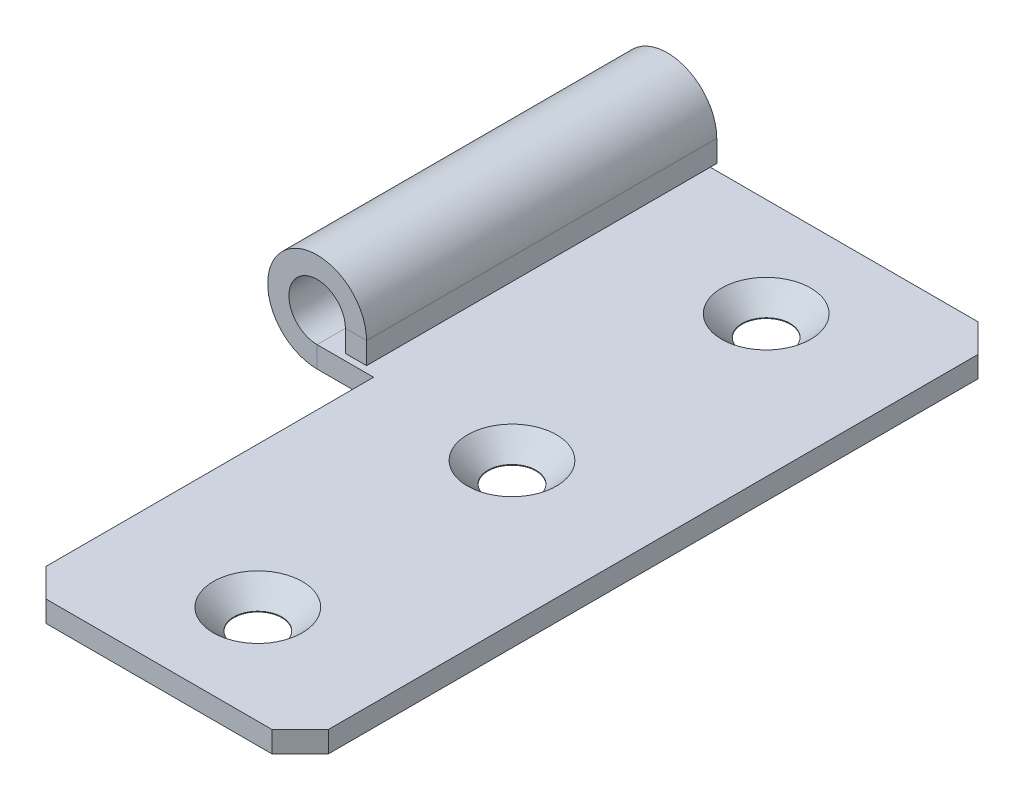
ISO-10303-21;
HEADER;
FILE_DESCRIPTION(('STEP AP214'),'2;1');
FILE_NAME('part.step','',(''),(''),'','','');
FILE_SCHEMA(('AUTOMOTIVE_DESIGN { 1 0 10303 214 1 1 1 1 }'));
ENDSEC;
DATA;
#1=APPLICATION_CONTEXT('core data for automotive mechanical design processes');
#2=APPLICATION_PROTOCOL_DEFINITION('international standard','automotive_design',2000,#1);
#3=PRODUCT_CONTEXT('',#1,'mechanical');
#4=PRODUCT('Part','Part','',(#3));
#5=PRODUCT_RELATED_PRODUCT_CATEGORY('part','',(#4));
#6=PRODUCT_DEFINITION_FORMATION('','',#4);
#7=PRODUCT_DEFINITION_CONTEXT('part definition',#1,'design');
#8=PRODUCT_DEFINITION('design','',#6,#7);
#9=PRODUCT_DEFINITION_SHAPE('','',#8);
#10=(LENGTH_UNIT() NAMED_UNIT(*) SI_UNIT(.MILLI.,.METRE.));
#11=(NAMED_UNIT(*) PLANE_ANGLE_UNIT() SI_UNIT($,.RADIAN.));
#12=(NAMED_UNIT(*) SI_UNIT($,.STERADIAN.) SOLID_ANGLE_UNIT());
#13=UNCERTAINTY_MEASURE_WITH_UNIT(LENGTH_MEASURE(1.E-05),#10,'distance_accuracy_value','');
#14=(GEOMETRIC_REPRESENTATION_CONTEXT(3) GLOBAL_UNCERTAINTY_ASSIGNED_CONTEXT((#13)) GLOBAL_UNIT_ASSIGNED_CONTEXT((#10,
#11,#12)) REPRESENTATION_CONTEXT('',''));
#15=CARTESIAN_POINT('',(0.,0.,0.));
#16=DIRECTION('',(0.,0.,1.));
#17=DIRECTION('',(1.,0.,0.));
#18=AXIS2_PLACEMENT_3D('',#15,#16,#17);
#19=CARTESIAN_POINT('',(-10.4999999999997,28.9590696960579,0.));
#20=DIRECTION('',(-1.,0.,0.));
#21=DIRECTION('',(0.,0.,1.));
#22=AXIS2_PLACEMENT_3D('',#19,#20,#21);
#23=PLANE('',#22);
#24=DIRECTION('',(0.,-1.,0.));
#25=VECTOR('',#24,1.);
#26=CARTESIAN_POINT('',(-10.5,0.459069696057891,-50.));
#27=LINE('',#26,#25);
#28=CARTESIAN_POINT('',(-10.5,1.99999999999997,-50.));
#29=VERTEX_POINT('',#28);
#30=CARTESIAN_POINT('',(-10.5,0.459069696057891,-50.));
#31=VERTEX_POINT('',#30);
#32=EDGE_CURVE('E46',#29,#31,#27,.T.);
#33=ORIENTED_EDGE('',*,*,#32,.F.);
#34=DIRECTION('',(0.,0.,1.));
#35=VECTOR('',#34,1.);
#36=CARTESIAN_POINT('',(-10.5,1.99999999999996,0.));
#37=LINE('',#36,#35);
#38=CARTESIAN_POINT('',(-10.5,1.99999999999996,-25.2));
#39=VERTEX_POINT('',#38);
#40=EDGE_CURVE('E86',#29,#39,#37,.T.);
#41=ORIENTED_EDGE('',*,*,#40,.T.);
#42=DIRECTION('',(0.,1.,0.));
#43=VECTOR('',#42,1.);
#44=CARTESIAN_POINT('',(-10.4999999999998,18.9590696960579,-25.2));
#45=LINE('',#44,#43);
#46=CARTESIAN_POINT('',(-10.5,0.459069696057891,-25.2));
#47=VERTEX_POINT('',#46);
#48=EDGE_CURVE('E106',#47,#39,#45,.T.);
#49=ORIENTED_EDGE('',*,*,#48,.F.);
#50=DIRECTION('',(0.,0.,1.));
#51=VECTOR('',#50,1.);
#52=CARTESIAN_POINT('',(-10.5,0.459069696057891,-25.2));
#53=LINE('',#52,#51);
#54=EDGE_CURVE('E85',#31,#47,#53,.T.);
#55=ORIENTED_EDGE('',*,*,#54,.F.);
#56=EDGE_LOOP('',(#33,#41,#49,#55));
#57=FACE_BOUND('',#56,.T.);
#58=ADVANCED_FACE('F42',(#57),#23,.F.);
#59=CARTESIAN_POINT('',(-10.4999999999998,18.9590696960579,-25.2));
#60=DIRECTION('',(0.,0.,1.));
#61=DIRECTION('',(0.,1.,0.));
#62=AXIS2_PLACEMENT_3D('',#59,#60,#61);
#63=PLANE('',#62);
#64=DIRECTION('',(1.,0.,0.));
#65=VECTOR('',#64,1.);
#66=CARTESIAN_POINT('',(-10.5,1.99999999999996,-25.2));
#67=LINE('',#66,#65);
#68=CARTESIAN_POINT('',(-12.,1.99999999999998,-25.2));
#69=VERTEX_POINT('',#68);
#70=EDGE_CURVE('E12',#69,#39,#67,.T.);
#71=ORIENTED_EDGE('',*,*,#70,.F.);
#72=DIRECTION('',(0.,1.,0.));
#73=VECTOR('',#72,1.);
#74=CARTESIAN_POINT('',(-11.9999999999998,18.9590696960579,-25.2));
#75=LINE('',#74,#73);
#76=CARTESIAN_POINT('',(-12.,0.459069696057909,-25.2));
#77=VERTEX_POINT('',#76);
#78=EDGE_CURVE('E91',#77,#69,#75,.T.);
#79=ORIENTED_EDGE('',*,*,#78,.F.);
#80=DIRECTION('',(-1.,0.,0.));
#81=VECTOR('',#80,1.);
#82=CARTESIAN_POINT('',(-10.5,0.459069696057891,-25.2));
#83=LINE('',#82,#81);
#84=EDGE_CURVE('E67',#47,#77,#83,.T.);
#85=ORIENTED_EDGE('',*,*,#84,.F.);
#86=ORIENTED_EDGE('',*,*,#48,.T.);
#87=EDGE_LOOP('',(#71,#79,#85,#86));
#88=FACE_BOUND('',#87,.T.);
#89=ADVANCED_FACE('F44',(#88),#63,.T.);
#90=CARTESIAN_POINT('',(-10.5,0.459069696057891,-25.2));
#91=DIRECTION('',(0.,-1.,0.));
#92=DIRECTION('',(0.,0.,1.));
#93=AXIS2_PLACEMENT_3D('',#90,#91,#92);
#94=PLANE('',#93);
#95=DIRECTION('',(0.,0.,1.));
#96=VECTOR('',#95,1.);
#97=CARTESIAN_POINT('',(-12.,0.459069696057909,-25.2));
#98=LINE('',#97,#96);
#99=CARTESIAN_POINT('',(-12.,0.459069696057909,-50.));
#100=VERTEX_POINT('',#99);
#101=EDGE_CURVE('E83',#100,#77,#98,.T.);
#102=ORIENTED_EDGE('',*,*,#101,.F.);
#103=DIRECTION('',(-1.,0.,0.));
#104=VECTOR('',#103,1.);
#105=CARTESIAN_POINT('',(-10.5,0.459069696057891,-50.));
#106=LINE('',#105,#104);
#107=EDGE_CURVE('E87',#31,#100,#106,.T.);
#108=ORIENTED_EDGE('',*,*,#107,.F.);
#109=ORIENTED_EDGE('',*,*,#54,.T.);
#110=ORIENTED_EDGE('',*,*,#84,.T.);
#111=EDGE_LOOP('',(#102,#108,#109,#110));
#112=FACE_BOUND('',#111,.T.);
#113=ADVANCED_FACE('F80',(#112),#94,.T.);
#114=CARTESIAN_POINT('',(-10.5,0.459069696057891,-50.));
#115=DIRECTION('',(0.,0.,-1.));
#116=DIRECTION('',(0.,-1.,0.));
#117=AXIS2_PLACEMENT_3D('',#114,#115,#116);
#118=PLANE('',#117);
#119=DIRECTION('',(-1.,0.,0.));
#120=VECTOR('',#119,1.);
#121=CARTESIAN_POINT('',(-10.5,1.99999999999996,-50.));
#122=LINE('',#121,#120);
#123=CARTESIAN_POINT('',(-12.,1.99999999999998,-50.));
#124=VERTEX_POINT('',#123);
#125=EDGE_CURVE('E109',#29,#124,#122,.T.);
#126=ORIENTED_EDGE('',*,*,#125,.F.);
#127=ORIENTED_EDGE('',*,*,#32,.T.);
#128=ORIENTED_EDGE('',*,*,#107,.T.);
#129=DIRECTION('',(0.,-1.,0.));
#130=VECTOR('',#129,1.);
#131=CARTESIAN_POINT('',(-12.,0.459069696057909,-50.));
#132=LINE('',#131,#130);
#133=EDGE_CURVE('E98',#124,#100,#132,.T.);
#134=ORIENTED_EDGE('',*,*,#133,.F.);
#135=EDGE_LOOP('',(#126,#127,#128,#134));
#136=FACE_BOUND('',#135,.T.);
#137=ADVANCED_FACE('F117',(#136),#118,.T.);
#138=CARTESIAN_POINT('',(-11.9999999999997,28.9590696960579,0.));
#139=DIRECTION('',(-1.,0.,0.));
#140=DIRECTION('',(0.,0.,1.));
#141=AXIS2_PLACEMENT_3D('',#138,#139,#140);
#142=PLANE('',#141);
#143=DIRECTION('',(0.,0.,1.));
#144=VECTOR('',#143,1.);
#145=CARTESIAN_POINT('',(-12.,1.99999999999998,0.));
#146=LINE('',#145,#144);
#147=EDGE_CURVE('E51',#124,#69,#146,.T.);
#148=ORIENTED_EDGE('',*,*,#147,.F.);
#149=ORIENTED_EDGE('',*,*,#133,.T.);
#150=ORIENTED_EDGE('',*,*,#101,.T.);
#151=ORIENTED_EDGE('',*,*,#78,.T.);
#152=EDGE_LOOP('',(#148,#149,#150,#151));
#153=FACE_BOUND('',#152,.T.);
#154=ADVANCED_FACE('F96',(#153),#142,.T.);
#155=CARTESIAN_POINT('',(0.,0.,-43.));
#156=DIRECTION('',(0.,1.,0.));
#157=DIRECTION('',(0.,0.,1.));
#158=AXIS2_PLACEMENT_3D('',#155,#156,#157);
#159=CONICAL_SURFACE('',#158,3.15,0.78539816339745);
#160=CARTESIAN_POINT('',(0.,-1.45,-43.));
#161=DIRECTION('',(0.,1.,0.));
#162=DIRECTION('',(0.,0.,1.));
#163=AXIS2_PLACEMENT_3D('',#160,#161,#162);
#164=CIRCLE('',#163,1.7);
#165=CARTESIAN_POINT('',(0.,-1.45,-41.3));
#166=VERTEX_POINT('',#165);
#167=EDGE_CURVE('E229',#166,#166,#164,.T.);
#168=ORIENTED_EDGE('',*,*,#167,.F.);
#169=EDGE_LOOP('',(#168));
#170=FACE_BOUND('',#169,.T.);
#171=CARTESIAN_POINT('',(0.,0.,-43.));
#172=DIRECTION('',(0.,1.,0.));
#173=DIRECTION('',(0.,0.,1.));
#174=AXIS2_PLACEMENT_3D('',#171,#172,#173);
#175=CIRCLE('',#174,3.15);
#176=CARTESIAN_POINT('',(0.,0.,-39.85));
#177=VERTEX_POINT('',#176);
#178=EDGE_CURVE('E244',#177,#177,#175,.T.);
#179=ORIENTED_EDGE('',*,*,#178,.T.);
#180=EDGE_LOOP('',(#179));
#181=FACE_BOUND('',#180,.T.);
#182=ADVANCED_FACE('F352',(#170,#181),#159,.F.);
#183=CARTESIAN_POINT('',(0.,0.,-25.));
#184=DIRECTION('',(0.,1.,0.));
#185=DIRECTION('',(0.,0.,1.));
#186=AXIS2_PLACEMENT_3D('',#183,#184,#185);
#187=CONICAL_SURFACE('',#186,3.15,0.78539816339745);
#188=CARTESIAN_POINT('',(0.,-1.45,-25.));
#189=DIRECTION('',(0.,1.,0.));
#190=DIRECTION('',(0.,0.,1.));
#191=AXIS2_PLACEMENT_3D('',#188,#189,#190);
#192=CIRCLE('',#191,1.7);
#193=CARTESIAN_POINT('',(0.,-1.45,-23.3));
#194=VERTEX_POINT('',#193);
#195=EDGE_CURVE('E232',#194,#194,#192,.T.);
#196=ORIENTED_EDGE('',*,*,#195,.F.);
#197=EDGE_LOOP('',(#196));
#198=FACE_BOUND('',#197,.T.);
#199=CARTESIAN_POINT('',(0.,0.,-25.));
#200=DIRECTION('',(0.,1.,0.));
#201=DIRECTION('',(0.,0.,1.));
#202=AXIS2_PLACEMENT_3D('',#199,#200,#201);
#203=CIRCLE('',#202,3.15);
#204=CARTESIAN_POINT('',(0.,0.,-21.85));
#205=VERTEX_POINT('',#204);
#206=EDGE_CURVE('E241',#205,#205,#203,.T.);
#207=ORIENTED_EDGE('',*,*,#206,.T.);
#208=EDGE_LOOP('',(#207));
#209=FACE_BOUND('',#208,.T.);
#210=ADVANCED_FACE('F356',(#198,#209),#187,.F.);
#211=CARTESIAN_POINT('',(0.,0.,-7.));
#212=DIRECTION('',(0.,1.,0.));
#213=DIRECTION('',(0.,0.,1.));
#214=AXIS2_PLACEMENT_3D('',#211,#212,#213);
#215=CONICAL_SURFACE('',#214,3.15,0.78539816339745);
#216=CARTESIAN_POINT('',(0.,-1.45,-7.));
#217=DIRECTION('',(0.,1.,0.));
#218=DIRECTION('',(0.,0.,1.));
#219=AXIS2_PLACEMENT_3D('',#216,#217,#218);
#220=CIRCLE('',#219,1.7);
#221=CARTESIAN_POINT('',(0.,-1.45,-5.3));
#222=VERTEX_POINT('',#221);
#223=EDGE_CURVE('E235',#222,#222,#220,.T.);
#224=ORIENTED_EDGE('',*,*,#223,.F.);
#225=EDGE_LOOP('',(#224));
#226=FACE_BOUND('',#225,.T.);
#227=CARTESIAN_POINT('',(0.,0.,-7.));
#228=DIRECTION('',(0.,1.,0.));
#229=DIRECTION('',(0.,0.,1.));
#230=AXIS2_PLACEMENT_3D('',#227,#228,#229);
#231=CIRCLE('',#230,3.15);
#232=CARTESIAN_POINT('',(0.,0.,-3.85));
#233=VERTEX_POINT('',#232);
#234=EDGE_CURVE('E238',#233,#233,#231,.T.);
#235=ORIENTED_EDGE('',*,*,#234,.T.);
#236=EDGE_LOOP('',(#235));
#237=FACE_BOUND('',#236,.T.);
#238=ADVANCED_FACE('F362',(#226,#237),#215,.F.);
#239=CARTESIAN_POINT('',(0.,0.,-7.));
#240=DIRECTION('',(0.,1.,0.));
#241=DIRECTION('',(0.,0.,1.));
#242=AXIS2_PLACEMENT_3D('',#239,#240,#241);
#243=CYLINDRICAL_SURFACE('',#242,1.7);
#244=CARTESIAN_POINT('',(0.,-1.5,-7.));
#245=DIRECTION('',(0.,1.,0.));
#246=DIRECTION('',(0.,0.,1.));
#247=AXIS2_PLACEMENT_3D('',#244,#245,#246);
#248=CIRCLE('',#247,1.7);
#249=CARTESIAN_POINT('',(0.,-1.5,-5.3));
#250=VERTEX_POINT('',#249);
#251=EDGE_CURVE('E187',#250,#250,#248,.T.);
#252=ORIENTED_EDGE('',*,*,#251,.F.);
#253=EDGE_LOOP('',(#252));
#254=FACE_BOUND('',#253,.T.);
#255=ORIENTED_EDGE('',*,*,#223,.T.);
#256=EDGE_LOOP('',(#255));
#257=FACE_BOUND('',#256,.T.);
#258=ADVANCED_FACE('F372',(#254,#257),#243,.F.);
#259=CARTESIAN_POINT('',(0.,0.,-25.));
#260=DIRECTION('',(0.,1.,0.));
#261=DIRECTION('',(0.,0.,1.));
#262=AXIS2_PLACEMENT_3D('',#259,#260,#261);
#263=CYLINDRICAL_SURFACE('',#262,1.7);
#264=CARTESIAN_POINT('',(0.,-1.5,-25.));
#265=DIRECTION('',(0.,1.,0.));
#266=DIRECTION('',(0.,0.,1.));
#267=AXIS2_PLACEMENT_3D('',#264,#265,#266);
#268=CIRCLE('',#267,1.7);
#269=CARTESIAN_POINT('',(0.,-1.5,-23.3));
#270=VERTEX_POINT('',#269);
#271=EDGE_CURVE('E190',#270,#270,#268,.T.);
#272=ORIENTED_EDGE('',*,*,#271,.F.);
#273=EDGE_LOOP('',(#272));
#274=FACE_BOUND('',#273,.T.);
#275=ORIENTED_EDGE('',*,*,#195,.T.);
#276=EDGE_LOOP('',(#275));
#277=FACE_BOUND('',#276,.T.);
#278=ADVANCED_FACE('F339',(#274,#277),#263,.F.);
#279=CARTESIAN_POINT('',(0.,0.,-43.));
#280=DIRECTION('',(0.,1.,0.));
#281=DIRECTION('',(0.,0.,1.));
#282=AXIS2_PLACEMENT_3D('',#279,#280,#281);
#283=CYLINDRICAL_SURFACE('',#282,1.7);
#284=CARTESIAN_POINT('',(0.,-1.5,-43.));
#285=DIRECTION('',(0.,1.,0.));
#286=DIRECTION('',(0.,0.,1.));
#287=AXIS2_PLACEMENT_3D('',#284,#285,#286);
#288=CIRCLE('',#287,1.7);
#289=CARTESIAN_POINT('',(0.,-1.5,-41.3));
#290=VERTEX_POINT('',#289);
#291=EDGE_CURVE('E193',#290,#290,#288,.T.);
#292=ORIENTED_EDGE('',*,*,#291,.F.);
#293=EDGE_LOOP('',(#292));
#294=FACE_BOUND('',#293,.T.);
#295=ORIENTED_EDGE('',*,*,#167,.T.);
#296=EDGE_LOOP('',(#295));
#297=FACE_BOUND('',#296,.T.);
#298=ADVANCED_FACE('F332',(#294,#297),#283,.F.);
#299=CARTESIAN_POINT('',(-10.,-1.5,-25.2));
#300=DIRECTION('',(-1.,0.,0.));
#301=DIRECTION('',(0.,0.,1.));
#302=AXIS2_PLACEMENT_3D('',#299,#300,#301);
#303=PLANE('',#302);
#304=DIRECTION('',(0.,0.,1.));
#305=VECTOR('',#304,1.);
#306=CARTESIAN_POINT('',(-10.,-1.5,-25.2));
#307=LINE('',#306,#305);
#308=CARTESIAN_POINT('',(-10.,-1.5,-25.2));
#309=VERTEX_POINT('',#308);
#310=CARTESIAN_POINT('',(-10.,-1.5,-2.00000000000001));
#311=VERTEX_POINT('',#310);
#312=EDGE_CURVE('E226',#309,#311,#307,.T.);
#313=ORIENTED_EDGE('',*,*,#312,.T.);
#314=DIRECTION('',(0.,1.,0.));
#315=VECTOR('',#314,1.);
#316=CARTESIAN_POINT('',(-10.,-1.5,-2.00000000000001));
#317=LINE('',#316,#315);
#318=CARTESIAN_POINT('',(-10.,0.,-2.00000000000001));
#319=VERTEX_POINT('',#318);
#320=EDGE_CURVE('E223',#311,#319,#317,.T.);
#321=ORIENTED_EDGE('',*,*,#320,.T.);
#322=DIRECTION('',(0.,0.,1.));
#323=VECTOR('',#322,1.);
#324=CARTESIAN_POINT('',(-10.,0.,-25.2));
#325=LINE('',#324,#323);
#326=CARTESIAN_POINT('',(-10.,0.,-25.2));
#327=VERTEX_POINT('',#326);
#328=EDGE_CURVE('E168',#327,#319,#325,.T.);
#329=ORIENTED_EDGE('',*,*,#328,.F.);
#330=DIRECTION('',(0.,1.,0.));
#331=VECTOR('',#330,1.);
#332=CARTESIAN_POINT('',(-10.,-1.5,-25.2));
#333=LINE('',#332,#331);
#334=EDGE_CURVE('E101',#309,#327,#333,.T.);
#335=ORIENTED_EDGE('',*,*,#334,.F.);
#336=EDGE_LOOP('',(#313,#321,#329,#335));
#337=FACE_BOUND('',#336,.T.);
#338=ADVANCED_FACE('F330',(#337),#303,.T.);
#339=CARTESIAN_POINT('',(-10.,-1.5,-2.00000000000001));
#340=DIRECTION('',(0.707106781186546,0.,-0.707106781186549));
#341=DIRECTION('',(0.,1.,0.));
#342=AXIS2_PLACEMENT_3D('',#339,#340,#341);
#343=PLANE('',#342);
#344=DIRECTION('',(0.707106781186549,0.,0.707106781186546));
#345=VECTOR('',#344,1.);
#346=CARTESIAN_POINT('',(-10.,-1.5,-2.00000000000001));
#347=LINE('',#346,#345);
#348=CARTESIAN_POINT('',(-7.99999999999998,-1.5,0.));
#349=VERTEX_POINT('',#348);
#350=EDGE_CURVE('E196',#349,#311,#347,.F.);
#351=ORIENTED_EDGE('',*,*,#350,.F.);
#352=DIRECTION('',(0.,-1.,0.));
#353=VECTOR('',#352,1.);
#354=CARTESIAN_POINT('',(-7.99999999999998,-1.5,0.));
#355=LINE('',#354,#353);
#356=CARTESIAN_POINT('',(-7.99999999999998,0.,0.));
#357=VERTEX_POINT('',#356);
#358=EDGE_CURVE('E220',#357,#349,#355,.T.);
#359=ORIENTED_EDGE('',*,*,#358,.F.);
#360=DIRECTION('',(-0.707106781186549,0.,-0.707106781186546));
#361=VECTOR('',#360,1.);
#362=CARTESIAN_POINT('',(-3.99999999999998,0.,3.99999999999999));
#363=LINE('',#362,#361);
#364=EDGE_CURVE('E165',#319,#357,#363,.F.);
#365=ORIENTED_EDGE('',*,*,#364,.F.);
#366=ORIENTED_EDGE('',*,*,#320,.F.);
#367=EDGE_LOOP('',(#351,#359,#365,#366));
#368=FACE_BOUND('',#367,.T.);
#369=ADVANCED_FACE('F327',(#368),#343,.F.);
#370=CARTESIAN_POINT('',(-10.,-1.5,0.));
#371=DIRECTION('',(0.,0.,1.));
#372=DIRECTION('',(1.,0.,0.));
#373=AXIS2_PLACEMENT_3D('',#370,#371,#372);
#374=PLANE('',#373);
#375=DIRECTION('',(1.,0.,0.));
#376=VECTOR('',#375,1.);
#377=CARTESIAN_POINT('',(-10.,0.,0.));
#378=LINE('',#377,#376);
#379=CARTESIAN_POINT('',(7.99999999999999,0.,0.));
#380=VERTEX_POINT('',#379);
#381=EDGE_CURVE('E162',#357,#380,#378,.T.);
#382=ORIENTED_EDGE('',*,*,#381,.F.);
#383=ORIENTED_EDGE('',*,*,#358,.T.);
#384=DIRECTION('',(1.,0.,0.));
#385=VECTOR('',#384,1.);
#386=CARTESIAN_POINT('',(-10.,-1.5,0.));
#387=LINE('',#386,#385);
#388=CARTESIAN_POINT('',(7.99999999999999,-1.5,0.));
#389=VERTEX_POINT('',#388);
#390=EDGE_CURVE('E217',#349,#389,#387,.T.);
#391=ORIENTED_EDGE('',*,*,#390,.T.);
#392=DIRECTION('',(0.,1.,0.));
#393=VECTOR('',#392,1.);
#394=CARTESIAN_POINT('',(7.99999999999999,-1.5,0.));
#395=LINE('',#394,#393);
#396=EDGE_CURVE('E214',#389,#380,#395,.T.);
#397=ORIENTED_EDGE('',*,*,#396,.T.);
#398=EDGE_LOOP('',(#382,#383,#391,#397));
#399=FACE_BOUND('',#398,.T.);
#400=ADVANCED_FACE('F324',(#399),#374,.T.);
#401=CARTESIAN_POINT('',(7.99999999999999,-1.5,0.));
#402=DIRECTION('',(-0.707106781186551,0.,-0.707106781186544));
#403=DIRECTION('',(0.,1.,0.));
#404=AXIS2_PLACEMENT_3D('',#401,#402,#403);
#405=PLANE('',#404);
#406=DIRECTION('',(0.707106781186544,0.,-0.707106781186551));
#407=VECTOR('',#406,1.);
#408=CARTESIAN_POINT('',(7.99999999999999,-1.5,0.));
#409=LINE('',#408,#407);
#410=CARTESIAN_POINT('',(10.,-1.5,-2.00000000000002));
#411=VERTEX_POINT('',#410);
#412=EDGE_CURVE('E199',#411,#389,#409,.F.);
#413=ORIENTED_EDGE('',*,*,#412,.F.);
#414=DIRECTION('',(0.,-1.,0.));
#415=VECTOR('',#414,1.);
#416=CARTESIAN_POINT('',(10.,-1.5,-2.00000000000002));
#417=LINE('',#416,#415);
#418=CARTESIAN_POINT('',(10.,0.,-2.00000000000002));
#419=VERTEX_POINT('',#418);
#420=EDGE_CURVE('E211',#419,#411,#417,.T.);
#421=ORIENTED_EDGE('',*,*,#420,.F.);
#422=DIRECTION('',(-0.707106781186544,0.,0.707106781186551));
#423=VECTOR('',#422,1.);
#424=CARTESIAN_POINT('',(4.00000000000003,0.,4.));
#425=LINE('',#424,#423);
#426=EDGE_CURVE('E159',#380,#419,#425,.F.);
#427=ORIENTED_EDGE('',*,*,#426,.F.);
#428=ORIENTED_EDGE('',*,*,#396,.F.);
#429=EDGE_LOOP('',(#413,#421,#427,#428));
#430=FACE_BOUND('',#429,.T.);
#431=ADVANCED_FACE('F318',(#430),#405,.F.);
#432=CARTESIAN_POINT('',(9.99999999999999,-1.5,-50.));
#433=DIRECTION('',(1.,0.,0.));
#434=DIRECTION('',(0.,0.,-1.));
#435=AXIS2_PLACEMENT_3D('',#432,#433,#434);
#436=PLANE('',#435);
#437=DIRECTION('',(0.,0.,-1.));
#438=VECTOR('',#437,1.);
#439=CARTESIAN_POINT('',(9.99999999999999,0.,-50.));
#440=LINE('',#439,#438);
#441=CARTESIAN_POINT('',(9.99999999999999,0.,-48.));
#442=VERTEX_POINT('',#441);
#443=EDGE_CURVE('E156',#419,#442,#440,.T.);
#444=ORIENTED_EDGE('',*,*,#443,.F.);
#445=ORIENTED_EDGE('',*,*,#420,.T.);
#446=DIRECTION('',(0.,0.,-1.));
#447=VECTOR('',#446,1.);
#448=CARTESIAN_POINT('',(9.99999999999999,-1.5,-50.));
#449=LINE('',#448,#447);
#450=CARTESIAN_POINT('',(9.99999999999999,-1.5,-48.));
#451=VERTEX_POINT('',#450);
#452=EDGE_CURVE('E208',#411,#451,#449,.T.);
#453=ORIENTED_EDGE('',*,*,#452,.T.);
#454=DIRECTION('',(0.,1.,0.));
#455=VECTOR('',#454,1.);
#456=CARTESIAN_POINT('',(9.99999999999999,-1.5,-48.));
#457=LINE('',#456,#455);
#458=EDGE_CURVE('E205',#451,#442,#457,.T.);
#459=ORIENTED_EDGE('',*,*,#458,.T.);
#460=EDGE_LOOP('',(#444,#445,#453,#459));
#461=FACE_BOUND('',#460,.T.);
#462=ADVANCED_FACE('F315',(#461),#436,.T.);
#463=CARTESIAN_POINT('',(9.99999999999999,-1.5,-48.));
#464=DIRECTION('',(-0.707106781186547,0.,0.707106781186547));
#465=DIRECTION('',(0.,1.,0.));
#466=AXIS2_PLACEMENT_3D('',#463,#464,#465);
#467=PLANE('',#466);
#468=DIRECTION('',(-0.707106781186548,0.,-0.707106781186548));
#469=VECTOR('',#468,1.);
#470=CARTESIAN_POINT('',(9.99999999999999,-1.5,-48.));
#471=LINE('',#470,#469);
#472=CARTESIAN_POINT('',(7.99999999999998,-1.5,-50.));
#473=VERTEX_POINT('',#472);
#474=EDGE_CURVE('E202',#473,#451,#471,.F.);
#475=ORIENTED_EDGE('',*,*,#474,.F.);
#476=DIRECTION('',(0.,-1.,0.));
#477=VECTOR('',#476,1.);
#478=CARTESIAN_POINT('',(7.99999999999999,-1.5,-50.));
#479=LINE('',#478,#477);
#480=CARTESIAN_POINT('',(7.99999999999998,0.,-50.));
#481=VERTEX_POINT('',#480);
#482=EDGE_CURVE('E180',#481,#473,#479,.T.);
#483=ORIENTED_EDGE('',*,*,#482,.F.);
#484=DIRECTION('',(0.707106781186548,0.,0.707106781186548));
#485=VECTOR('',#484,1.);
#486=CARTESIAN_POINT('',(29.,0.,-29.));
#487=LINE('',#486,#485);
#488=EDGE_CURVE('E153',#442,#481,#487,.F.);
#489=ORIENTED_EDGE('',*,*,#488,.F.);
#490=ORIENTED_EDGE('',*,*,#458,.F.);
#491=EDGE_LOOP('',(#475,#483,#489,#490));
#492=FACE_BOUND('',#491,.T.);
#493=ADVANCED_FACE('F311',(#492),#467,.F.);
#494=CARTESIAN_POINT('',(0.,-1.5,0.));
#495=DIRECTION('',(0.,1.,0.));
#496=DIRECTION('',(0.,0.,1.));
#497=AXIS2_PLACEMENT_3D('',#494,#495,#496);
#498=PLANE('',#497);
#499=DIRECTION('',(0.,0.,1.));
#500=VECTOR('',#499,1.);
#501=CARTESIAN_POINT('',(-14.,-1.5,0.));
#502=LINE('',#501,#500);
#503=CARTESIAN_POINT('',(-14.,-1.5,-50.));
#504=VERTEX_POINT('',#503);
#505=CARTESIAN_POINT('',(-14.,-1.5,-25.2));
#506=VERTEX_POINT('',#505);
#507=EDGE_CURVE('E138',#504,#506,#502,.T.);
#508=ORIENTED_EDGE('',*,*,#507,.F.);
#509=DIRECTION('',(-1.,0.,0.));
#510=VECTOR('',#509,1.);
#511=CARTESIAN_POINT('',(-28.5,-1.5,-50.));
#512=LINE('',#511,#510);
#513=EDGE_CURVE('E184',#473,#504,#512,.T.);
#514=ORIENTED_EDGE('',*,*,#513,.F.);
#515=ORIENTED_EDGE('',*,*,#474,.T.);
#516=ORIENTED_EDGE('',*,*,#452,.F.);
#517=ORIENTED_EDGE('',*,*,#412,.T.);
#518=ORIENTED_EDGE('',*,*,#390,.F.);
#519=ORIENTED_EDGE('',*,*,#350,.T.);
#520=ORIENTED_EDGE('',*,*,#312,.F.);
#521=DIRECTION('',(1.,0.,0.));
#522=VECTOR('',#521,1.);
#523=CARTESIAN_POINT('',(-10.,-1.5,-25.2));
#524=LINE('',#523,#522);
#525=EDGE_CURVE('E147',#506,#309,#524,.T.);
#526=ORIENTED_EDGE('',*,*,#525,.F.);
#527=EDGE_LOOP('',(#508,#514,#515,#516,#517,#518,#519,#520,#526));
#528=FACE_BOUND('',#527,.T.);
#529=ORIENTED_EDGE('',*,*,#291,.T.);
#530=EDGE_LOOP('',(#529));
#531=FACE_BOUND('',#530,.T.);
#532=ORIENTED_EDGE('',*,*,#271,.T.);
#533=EDGE_LOOP('',(#532));
#534=FACE_BOUND('',#533,.T.);
#535=ORIENTED_EDGE('',*,*,#251,.T.);
#536=EDGE_LOOP('',(#535));
#537=FACE_BOUND('',#536,.T.);
#538=ADVANCED_FACE('F257',(#528,#531,#534,#537),#498,.F.);
#539=CARTESIAN_POINT('',(-28.5,-1.5,-50.));
#540=DIRECTION('',(0.,0.,-1.));
#541=DIRECTION('',(-1.,0.,0.));
#542=AXIS2_PLACEMENT_3D('',#539,#540,#541);
#543=PLANE('',#542);
#544=ORIENTED_EDGE('',*,*,#513,.T.);
#545=DIRECTION('',(0.,1.,0.));
#546=VECTOR('',#545,1.);
#547=CARTESIAN_POINT('',(-14.,-1.5,-50.));
#548=LINE('',#547,#546);
#549=CARTESIAN_POINT('',(-14.,0.,-50.));
#550=VERTEX_POINT('',#549);
#551=EDGE_CURVE('E135',#504,#550,#548,.T.);
#552=ORIENTED_EDGE('',*,*,#551,.T.);
#553=DIRECTION('',(-1.,0.,0.));
#554=VECTOR('',#553,1.);
#555=CARTESIAN_POINT('',(-28.5,0.,-50.));
#556=LINE('',#555,#554);
#557=EDGE_CURVE('E177',#481,#550,#556,.T.);
#558=ORIENTED_EDGE('',*,*,#557,.F.);
#559=ORIENTED_EDGE('',*,*,#482,.T.);
#560=EDGE_LOOP('',(#544,#552,#558,#559));
#561=FACE_BOUND('',#560,.T.);
#562=ADVANCED_FACE('F309',(#561),#543,.T.);
#563=CARTESIAN_POINT('',(0.,0.,0.));
#564=DIRECTION('',(0.,1.,0.));
#565=DIRECTION('',(0.,0.,1.));
#566=AXIS2_PLACEMENT_3D('',#563,#564,#565);
#567=PLANE('',#566);
#568=ORIENTED_EDGE('',*,*,#234,.F.);
#569=EDGE_LOOP('',(#568));
#570=FACE_BOUND('',#569,.T.);
#571=ORIENTED_EDGE('',*,*,#206,.F.);
#572=EDGE_LOOP('',(#571));
#573=FACE_BOUND('',#572,.T.);
#574=ORIENTED_EDGE('',*,*,#178,.F.);
#575=EDGE_LOOP('',(#574));
#576=FACE_BOUND('',#575,.T.);
#577=ORIENTED_EDGE('',*,*,#557,.T.);
#578=DIRECTION('',(0.,0.,1.));
#579=VECTOR('',#578,1.);
#580=CARTESIAN_POINT('',(-14.,0.,0.));
#581=LINE('',#580,#579);
#582=CARTESIAN_POINT('',(-14.,0.,-25.2));
#583=VERTEX_POINT('',#582);
#584=EDGE_CURVE('E174',#550,#583,#581,.T.);
#585=ORIENTED_EDGE('',*,*,#584,.T.);
#586=DIRECTION('',(1.,0.,0.));
#587=VECTOR('',#586,1.);
#588=CARTESIAN_POINT('',(-10.,0.,-25.2));
#589=LINE('',#588,#587);
#590=EDGE_CURVE('E171',#583,#327,#589,.T.);
#591=ORIENTED_EDGE('',*,*,#590,.T.);
#592=ORIENTED_EDGE('',*,*,#328,.T.);
#593=ORIENTED_EDGE('',*,*,#364,.T.);
#594=ORIENTED_EDGE('',*,*,#381,.T.);
#595=ORIENTED_EDGE('',*,*,#426,.T.);
#596=ORIENTED_EDGE('',*,*,#443,.T.);
#597=ORIENTED_EDGE('',*,*,#488,.T.);
#598=EDGE_LOOP('',(#577,#585,#591,#592,#593,#594,#595,#596,#597));
#599=FACE_BOUND('',#598,.T.);
#600=ADVANCED_FACE('F268',(#570,#573,#576,#599),#567,.T.);
#601=CARTESIAN_POINT('',(-10.,-1.5,-25.2));
#602=DIRECTION('',(0.,0.,1.));
#603=DIRECTION('',(1.,0.,0.));
#604=AXIS2_PLACEMENT_3D('',#601,#602,#603);
#605=PLANE('',#604);
#606=ORIENTED_EDGE('',*,*,#590,.F.);
#607=DIRECTION('',(0.,-1.,0.));
#608=VECTOR('',#607,1.);
#609=CARTESIAN_POINT('',(-14.,-1.5,-25.2));
#610=LINE('',#609,#608);
#611=EDGE_CURVE('E150',#583,#506,#610,.T.);
#612=ORIENTED_EDGE('',*,*,#611,.T.);
#613=ORIENTED_EDGE('',*,*,#525,.T.);
#614=ORIENTED_EDGE('',*,*,#334,.T.);
#615=EDGE_LOOP('',(#606,#612,#613,#614));
#616=FACE_BOUND('',#615,.T.);
#617=ADVANCED_FACE('F262',(#616),#605,.T.);
#618=CARTESIAN_POINT('',(-14.,2.,-50.));
#619=DIRECTION('',(0.,0.,-1.));
#620=DIRECTION('',(-1.,0.,0.));
#621=AXIS2_PLACEMENT_3D('',#618,#619,#620);
#622=PLANE('',#621);
#623=ORIENTED_EDGE('',*,*,#125,.T.);
#624=CARTESIAN_POINT('',(-14.,2.,-50.));
#625=DIRECTION('',(0.,0.,-1.));
#626=DIRECTION('',(-1.,0.,0.));
#627=AXIS2_PLACEMENT_3D('',#624,#625,#626);
#628=CIRCLE('',#627,2.);
#629=EDGE_CURVE('E141',#124,#550,#628,.F.);
#630=ORIENTED_EDGE('',*,*,#629,.T.);
#631=ORIENTED_EDGE('',*,*,#551,.F.);
#632=CARTESIAN_POINT('',(-14.,2.,-50.));
#633=DIRECTION('',(0.,0.,1.));
#634=DIRECTION('',(-1.,0.,0.));
#635=AXIS2_PLACEMENT_3D('',#632,#633,#634);
#636=CIRCLE('',#635,3.5);
#637=EDGE_CURVE('E124',#29,#504,#636,.T.);
#638=ORIENTED_EDGE('',*,*,#637,.F.);
#639=EDGE_LOOP('',(#623,#630,#631,#638));
#640=FACE_BOUND('',#639,.T.);
#641=ADVANCED_FACE('F130',(#640),#622,.T.);
#642=CARTESIAN_POINT('',(-14.,2.,-25.2));
#643=DIRECTION('',(0.,0.,1.));
#644=DIRECTION('',(1.,0.,0.));
#645=AXIS2_PLACEMENT_3D('',#642,#643,#644);
#646=PLANE('',#645);
#647=CARTESIAN_POINT('',(-14.,2.,-25.2));
#648=DIRECTION('',(0.,0.,-1.));
#649=DIRECTION('',(-1.,0.,0.));
#650=AXIS2_PLACEMENT_3D('',#647,#648,#649);
#651=CIRCLE('',#650,2.);
#652=EDGE_CURVE('E136',#583,#69,#651,.T.);
#653=ORIENTED_EDGE('',*,*,#652,.T.);
#654=ORIENTED_EDGE('',*,*,#70,.T.);
#655=CARTESIAN_POINT('',(-14.,2.,-25.2));
#656=DIRECTION('',(0.,0.,-1.));
#657=DIRECTION('',(1.,0.,0.));
#658=AXIS2_PLACEMENT_3D('',#655,#656,#657);
#659=CIRCLE('',#658,3.5);
#660=EDGE_CURVE('E59',#506,#39,#659,.T.);
#661=ORIENTED_EDGE('',*,*,#660,.F.);
#662=ORIENTED_EDGE('',*,*,#611,.F.);
#663=EDGE_LOOP('',(#653,#654,#661,#662));
#664=FACE_BOUND('',#663,.T.);
#665=ADVANCED_FACE('F254',(#664),#646,.T.);
#666=CARTESIAN_POINT('',(-14.,2.,-9.57808915531835));
#667=DIRECTION('',(0.,0.,-1.));
#668=DIRECTION('',(-1.,0.,0.));
#669=AXIS2_PLACEMENT_3D('',#666,#667,#668);
#670=CYLINDRICAL_SURFACE('',#669,3.5);
#671=ORIENTED_EDGE('',*,*,#507,.T.);
#672=ORIENTED_EDGE('',*,*,#660,.T.);
#673=ORIENTED_EDGE('',*,*,#40,.F.);
#674=ORIENTED_EDGE('',*,*,#637,.T.);
#675=EDGE_LOOP('',(#671,#672,#673,#674));
#676=FACE_BOUND('',#675,.T.);
#677=ADVANCED_FACE('F122',(#676),#670,.T.);
#678=CARTESIAN_POINT('',(-14.,2.,-9.57808915531835));
#679=DIRECTION('',(0.,0.,-1.));
#680=DIRECTION('',(-1.,0.,0.));
#681=AXIS2_PLACEMENT_3D('',#678,#679,#680);
#682=CYLINDRICAL_SURFACE('',#681,2.);
#683=ORIENTED_EDGE('',*,*,#584,.F.);
#684=ORIENTED_EDGE('',*,*,#629,.F.);
#685=ORIENTED_EDGE('',*,*,#147,.T.);
#686=ORIENTED_EDGE('',*,*,#652,.F.);
#687=EDGE_LOOP('',(#683,#684,#685,#686));
#688=FACE_BOUND('',#687,.T.);
#689=ADVANCED_FACE('F271',(#688),#682,.F.);
#690=CLOSED_SHELL('',(#58,#89,#113,#137,#154,#182,#210,#238,#258,#278,#298,#338,#369,#400,#431,
#462,#493,#538,#562,#600,#617,#641,#665,#677,#689));
#691=MANIFOLD_SOLID_BREP('B2',#690);
#692=ADVANCED_BREP_SHAPE_REPRESENTATION('',(#18,#691),#14);
#693=SHAPE_DEFINITION_REPRESENTATION(#9,#692);
ENDSEC;
END-ISO-10303-21;
